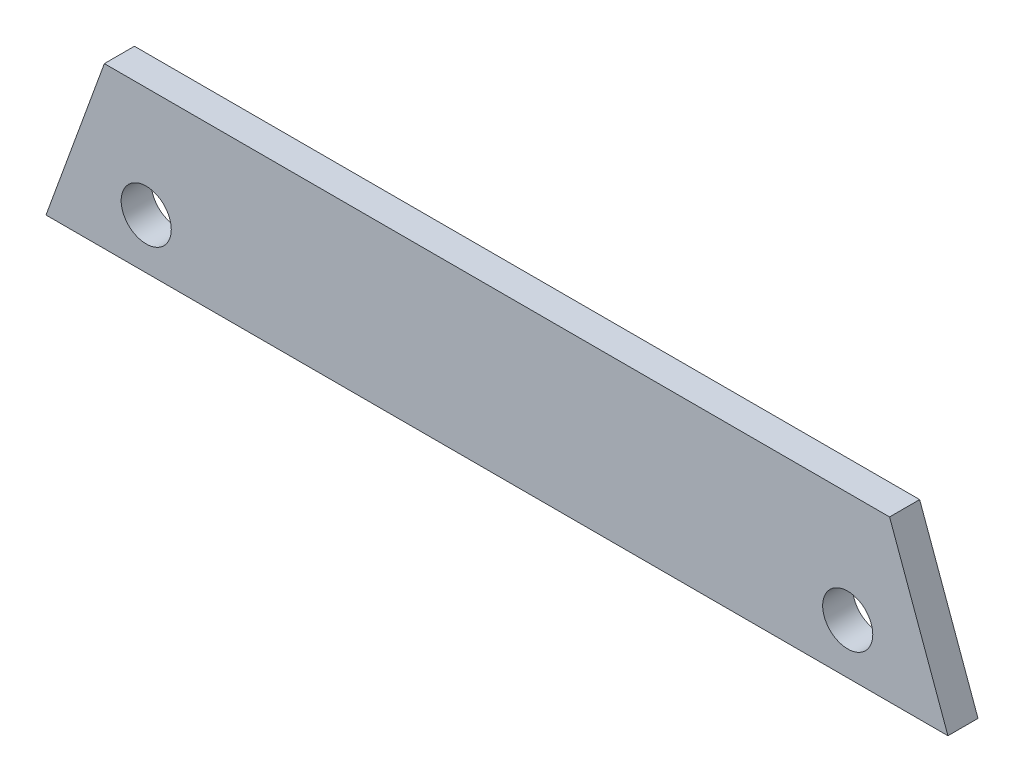
ISO-10303-21;
HEADER;
FILE_DESCRIPTION(('STEP AP214'),'2;1');
FILE_NAME('part.step','',(''),(''),'','','');
FILE_SCHEMA(('AUTOMOTIVE_DESIGN { 1 0 10303 214 1 1 1 1 }'));
ENDSEC;
DATA;
#1=APPLICATION_CONTEXT('core data for automotive mechanical design processes');
#2=APPLICATION_PROTOCOL_DEFINITION('international standard','automotive_design',2000,#1);
#3=PRODUCT_CONTEXT('',#1,'mechanical');
#4=PRODUCT('Part','Part','',(#3));
#5=PRODUCT_RELATED_PRODUCT_CATEGORY('part','',(#4));
#6=PRODUCT_DEFINITION_FORMATION('','',#4);
#7=PRODUCT_DEFINITION_CONTEXT('part definition',#1,'design');
#8=PRODUCT_DEFINITION('design','',#6,#7);
#9=PRODUCT_DEFINITION_SHAPE('','',#8);
#10=(LENGTH_UNIT() NAMED_UNIT(*) SI_UNIT(.MILLI.,.METRE.));
#11=(NAMED_UNIT(*) PLANE_ANGLE_UNIT() SI_UNIT($,.RADIAN.));
#12=(NAMED_UNIT(*) SI_UNIT($,.STERADIAN.) SOLID_ANGLE_UNIT());
#13=UNCERTAINTY_MEASURE_WITH_UNIT(LENGTH_MEASURE(1.E-05),#10,'distance_accuracy_value','');
#14=(GEOMETRIC_REPRESENTATION_CONTEXT(3) GLOBAL_UNCERTAINTY_ASSIGNED_CONTEXT((#13)) GLOBAL_UNIT_ASSIGNED_CONTEXT((#10,
#11,#12)) REPRESENTATION_CONTEXT('',''));
#15=CARTESIAN_POINT('',(0.,0.,0.));
#16=DIRECTION('',(0.,0.,1.));
#17=DIRECTION('',(1.,0.,0.));
#18=AXIS2_PLACEMENT_3D('',#15,#16,#17);
#19=CARTESIAN_POINT('',(0.,0.,3.));
#20=DIRECTION('',(0.,0.,1.));
#21=DIRECTION('',(1.,0.,0.));
#22=AXIS2_PLACEMENT_3D('',#19,#20,#21);
#23=PLANE('',#22);
#24=CARTESIAN_POINT('',(-35.,5.,3.));
#25=DIRECTION('',(0.,0.,1.));
#26=DIRECTION('',(1.,0.,0.));
#27=AXIS2_PLACEMENT_3D('',#24,#25,#26);
#28=CIRCLE('',#27,2.5);
#29=CARTESIAN_POINT('',(-32.5,5.,3.));
#30=VERTEX_POINT('',#29);
#31=EDGE_CURVE('E100',#30,#30,#28,.T.);
#32=ORIENTED_EDGE('',*,*,#31,.F.);
#33=EDGE_LOOP('',(#32));
#34=FACE_BOUND('',#33,.T.);
#35=DIRECTION('',(-0.342020143325673,-0.939692620785907,0.));
#36=VECTOR('',#35,1.);
#37=CARTESIAN_POINT('',(-39.1764762517407,16.,3.));
#38=LINE('',#37,#36);
#39=CARTESIAN_POINT('',(-39.1764762517407,16.,3.));
#40=VERTEX_POINT('',#39);
#41=CARTESIAN_POINT('',(-45.,0.,3.));
#42=VERTEX_POINT('',#41);
#43=EDGE_CURVE('E85',#40,#42,#38,.T.);
#44=ORIENTED_EDGE('',*,*,#43,.T.);
#45=DIRECTION('',(1.,0.,0.));
#46=VECTOR('',#45,1.);
#47=CARTESIAN_POINT('',(-45.,0.,3.));
#48=LINE('',#47,#46);
#49=CARTESIAN_POINT('',(45.,0.,3.));
#50=VERTEX_POINT('',#49);
#51=EDGE_CURVE('E80',#42,#50,#48,.T.);
#52=ORIENTED_EDGE('',*,*,#51,.T.);
#53=DIRECTION('',(-0.342020143325673,0.939692620785907,0.));
#54=VECTOR('',#53,1.);
#55=CARTESIAN_POINT('',(45.,0.,3.));
#56=LINE('',#55,#54);
#57=CARTESIAN_POINT('',(39.1764762517407,16.,3.));
#58=VERTEX_POINT('',#57);
#59=EDGE_CURVE('E83',#50,#58,#56,.T.);
#60=ORIENTED_EDGE('',*,*,#59,.T.);
#61=DIRECTION('',(-1.,0.,0.));
#62=VECTOR('',#61,1.);
#63=CARTESIAN_POINT('',(39.1764762517407,16.,3.));
#64=LINE('',#63,#62);
#65=EDGE_CURVE('E50',#58,#40,#64,.T.);
#66=ORIENTED_EDGE('',*,*,#65,.T.);
#67=EDGE_LOOP('',(#44,#52,#60,#66));
#68=FACE_BOUND('',#67,.T.);
#69=CARTESIAN_POINT('',(35.,5.,3.));
#70=DIRECTION('',(0.,0.,1.));
#71=DIRECTION('',(1.,0.,0.));
#72=AXIS2_PLACEMENT_3D('',#69,#70,#71);
#73=CIRCLE('',#72,2.5);
#74=CARTESIAN_POINT('',(37.5,5.,3.));
#75=VERTEX_POINT('',#74);
#76=EDGE_CURVE('E115',#75,#75,#73,.T.);
#77=ORIENTED_EDGE('',*,*,#76,.F.);
#78=EDGE_LOOP('',(#77));
#79=FACE_BOUND('',#78,.T.);
#80=ADVANCED_FACE('F33',(#34,#68,#79),#23,.T.);
#81=CARTESIAN_POINT('',(0.,0.,0.));
#82=DIRECTION('',(0.,0.,1.));
#83=DIRECTION('',(1.,0.,0.));
#84=AXIS2_PLACEMENT_3D('',#81,#82,#83);
#85=PLANE('',#84);
#86=DIRECTION('',(-0.342020143325673,-0.939692620785907,0.));
#87=VECTOR('',#86,1.);
#88=CARTESIAN_POINT('',(-39.1764762517407,16.,0.));
#89=LINE('',#88,#87);
#90=CARTESIAN_POINT('',(-39.1764762517407,16.,0.));
#91=VERTEX_POINT('',#90);
#92=CARTESIAN_POINT('',(-45.,0.,0.));
#93=VERTEX_POINT('',#92);
#94=EDGE_CURVE('E97',#91,#93,#89,.T.);
#95=ORIENTED_EDGE('',*,*,#94,.F.);
#96=DIRECTION('',(-1.,0.,0.));
#97=VECTOR('',#96,1.);
#98=CARTESIAN_POINT('',(39.1764762517407,16.,0.));
#99=LINE('',#98,#97);
#100=CARTESIAN_POINT('',(39.1764762517407,16.,0.));
#101=VERTEX_POINT('',#100);
#102=EDGE_CURVE('E73',#101,#91,#99,.T.);
#103=ORIENTED_EDGE('',*,*,#102,.F.);
#104=DIRECTION('',(-0.342020143325673,0.939692620785907,0.));
#105=VECTOR('',#104,1.);
#106=CARTESIAN_POINT('',(45.,0.,0.));
#107=LINE('',#106,#105);
#108=CARTESIAN_POINT('',(45.,0.,0.));
#109=VERTEX_POINT('',#108);
#110=EDGE_CURVE('E67',#109,#101,#107,.T.);
#111=ORIENTED_EDGE('',*,*,#110,.F.);
#112=DIRECTION('',(1.,0.,0.));
#113=VECTOR('',#112,1.);
#114=CARTESIAN_POINT('',(-45.,0.,0.));
#115=LINE('',#114,#113);
#116=EDGE_CURVE('E89',#93,#109,#115,.T.);
#117=ORIENTED_EDGE('',*,*,#116,.F.);
#118=EDGE_LOOP('',(#95,#103,#111,#117));
#119=FACE_BOUND('',#118,.T.);
#120=CARTESIAN_POINT('',(-35.,5.,0.));
#121=DIRECTION('',(0.,0.,1.));
#122=DIRECTION('',(1.,0.,0.));
#123=AXIS2_PLACEMENT_3D('',#120,#121,#122);
#124=CIRCLE('',#123,2.5);
#125=CARTESIAN_POINT('',(-32.5,5.,0.));
#126=VERTEX_POINT('',#125);
#127=EDGE_CURVE('E112',#126,#126,#124,.T.);
#128=ORIENTED_EDGE('',*,*,#127,.T.);
#129=EDGE_LOOP('',(#128));
#130=FACE_BOUND('',#129,.T.);
#131=CARTESIAN_POINT('',(35.,5.,0.));
#132=DIRECTION('',(0.,0.,1.));
#133=DIRECTION('',(1.,0.,0.));
#134=AXIS2_PLACEMENT_3D('',#131,#132,#133);
#135=CIRCLE('',#134,2.5);
#136=CARTESIAN_POINT('',(37.5,5.,0.));
#137=VERTEX_POINT('',#136);
#138=EDGE_CURVE('E118',#137,#137,#135,.T.);
#139=ORIENTED_EDGE('',*,*,#138,.T.);
#140=EDGE_LOOP('',(#139));
#141=FACE_BOUND('',#140,.T.);
#142=ADVANCED_FACE('F108',(#119,#130,#141),#85,.F.);
#143=CARTESIAN_POINT('',(-39.1764762517407,16.,3.));
#144=DIRECTION('',(0.939692620785907,-0.342020143325673,0.));
#145=DIRECTION('',(0.342020143325673,0.939692620785907,0.));
#146=AXIS2_PLACEMENT_3D('',#143,#144,#145);
#147=PLANE('',#146);
#148=ORIENTED_EDGE('',*,*,#94,.T.);
#149=DIRECTION('',(0.,0.,-1.));
#150=VECTOR('',#149,1.);
#151=CARTESIAN_POINT('',(-45.,0.,3.));
#152=LINE('',#151,#150);
#153=EDGE_CURVE('E11',#42,#93,#152,.T.);
#154=ORIENTED_EDGE('',*,*,#153,.F.);
#155=ORIENTED_EDGE('',*,*,#43,.F.);
#156=DIRECTION('',(0.,0.,-1.));
#157=VECTOR('',#156,1.);
#158=CARTESIAN_POINT('',(-39.1764762517407,16.,3.));
#159=LINE('',#158,#157);
#160=EDGE_CURVE('E93',#40,#91,#159,.T.);
#161=ORIENTED_EDGE('',*,*,#160,.T.);
#162=EDGE_LOOP('',(#148,#154,#155,#161));
#163=FACE_BOUND('',#162,.T.);
#164=ADVANCED_FACE('F35',(#163),#147,.F.);
#165=CARTESIAN_POINT('',(-45.,0.,3.));
#166=DIRECTION('',(0.,1.,0.));
#167=DIRECTION('',(0.,0.,1.));
#168=AXIS2_PLACEMENT_3D('',#165,#166,#167);
#169=PLANE('',#168);
#170=ORIENTED_EDGE('',*,*,#116,.T.);
#171=DIRECTION('',(0.,0.,-1.));
#172=VECTOR('',#171,1.);
#173=CARTESIAN_POINT('',(45.,0.,3.));
#174=LINE('',#173,#172);
#175=EDGE_CURVE('E42',#50,#109,#174,.T.);
#176=ORIENTED_EDGE('',*,*,#175,.F.);
#177=ORIENTED_EDGE('',*,*,#51,.F.);
#178=ORIENTED_EDGE('',*,*,#153,.T.);
#179=EDGE_LOOP('',(#170,#176,#177,#178));
#180=FACE_BOUND('',#179,.T.);
#181=ADVANCED_FACE('F88',(#180),#169,.F.);
#182=CARTESIAN_POINT('',(45.,0.,3.));
#183=DIRECTION('',(-0.939692620785907,-0.342020143325673,0.));
#184=DIRECTION('',(0.342020143325673,-0.939692620785907,0.));
#185=AXIS2_PLACEMENT_3D('',#182,#183,#184);
#186=PLANE('',#185);
#187=ORIENTED_EDGE('',*,*,#110,.T.);
#188=DIRECTION('',(0.,0.,-1.));
#189=VECTOR('',#188,1.);
#190=CARTESIAN_POINT('',(39.1764762517407,16.,3.));
#191=LINE('',#190,#189);
#192=EDGE_CURVE('E90',#58,#101,#191,.T.);
#193=ORIENTED_EDGE('',*,*,#192,.F.);
#194=ORIENTED_EDGE('',*,*,#59,.F.);
#195=ORIENTED_EDGE('',*,*,#175,.T.);
#196=EDGE_LOOP('',(#187,#193,#194,#195));
#197=FACE_BOUND('',#196,.T.);
#198=ADVANCED_FACE('F91',(#197),#186,.F.);
#199=CARTESIAN_POINT('',(39.1764762517407,16.,3.));
#200=DIRECTION('',(0.,-1.,0.));
#201=DIRECTION('',(1.,0.,0.));
#202=AXIS2_PLACEMENT_3D('',#199,#200,#201);
#203=PLANE('',#202);
#204=ORIENTED_EDGE('',*,*,#102,.T.);
#205=ORIENTED_EDGE('',*,*,#160,.F.);
#206=ORIENTED_EDGE('',*,*,#65,.F.);
#207=ORIENTED_EDGE('',*,*,#192,.T.);
#208=EDGE_LOOP('',(#204,#205,#206,#207));
#209=FACE_BOUND('',#208,.T.);
#210=ADVANCED_FACE('F105',(#209),#203,.F.);
#211=CARTESIAN_POINT('',(-35.,5.,3.));
#212=DIRECTION('',(0.,0.,-1.));
#213=DIRECTION('',(-1.,0.,0.));
#214=AXIS2_PLACEMENT_3D('',#211,#212,#213);
#215=CYLINDRICAL_SURFACE('',#214,2.5);
#216=ORIENTED_EDGE('',*,*,#31,.T.);
#217=EDGE_LOOP('',(#216));
#218=FACE_BOUND('',#217,.T.);
#219=ORIENTED_EDGE('',*,*,#127,.F.);
#220=EDGE_LOOP('',(#219));
#221=FACE_BOUND('',#220,.T.);
#222=ADVANCED_FACE('F135',(#218,#221),#215,.F.);
#223=CARTESIAN_POINT('',(35.,5.,3.));
#224=DIRECTION('',(0.,0.,-1.));
#225=DIRECTION('',(-1.,0.,0.));
#226=AXIS2_PLACEMENT_3D('',#223,#224,#225);
#227=CYLINDRICAL_SURFACE('',#226,2.5);
#228=ORIENTED_EDGE('',*,*,#76,.T.);
#229=EDGE_LOOP('',(#228));
#230=FACE_BOUND('',#229,.T.);
#231=ORIENTED_EDGE('',*,*,#138,.F.);
#232=EDGE_LOOP('',(#231));
#233=FACE_BOUND('',#232,.T.);
#234=ADVANCED_FACE('F124',(#230,#233),#227,.F.);
#235=CLOSED_SHELL('',(#80,#142,#164,#181,#198,#210,#222,#234));
#236=MANIFOLD_SOLID_BREP('B2',#235);
#237=ADVANCED_BREP_SHAPE_REPRESENTATION('',(#18,#236),#14);
#238=SHAPE_DEFINITION_REPRESENTATION(#9,#237);
ENDSEC;
END-ISO-10303-21;
